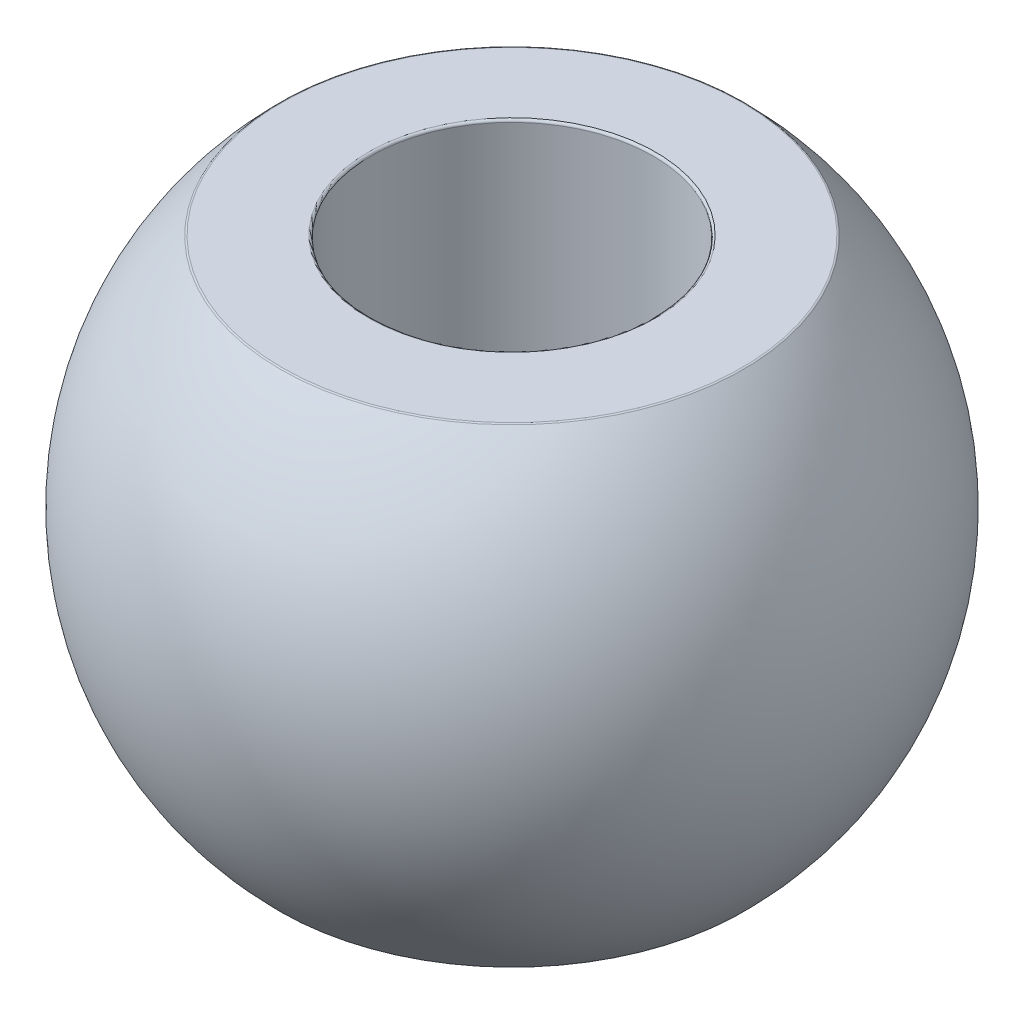
ISO-10303-21;
HEADER;
FILE_DESCRIPTION(('STEP AP214'),'2;1');
FILE_NAME('part.step','',(''),(''),'','','');
FILE_SCHEMA(('AUTOMOTIVE_DESIGN { 1 0 10303 214 1 1 1 1 }'));
ENDSEC;
DATA;
#1=APPLICATION_CONTEXT('core data for automotive mechanical design processes');
#2=APPLICATION_PROTOCOL_DEFINITION('international standard','automotive_design',2000,#1);
#3=PRODUCT_CONTEXT('',#1,'mechanical');
#4=PRODUCT('Part','Part','',(#3));
#5=PRODUCT_RELATED_PRODUCT_CATEGORY('part','',(#4));
#6=PRODUCT_DEFINITION_FORMATION('','',#4);
#7=PRODUCT_DEFINITION_CONTEXT('part definition',#1,'design');
#8=PRODUCT_DEFINITION('design','',#6,#7);
#9=PRODUCT_DEFINITION_SHAPE('','',#8);
#10=(LENGTH_UNIT() NAMED_UNIT(*) SI_UNIT(.MILLI.,.METRE.));
#11=(NAMED_UNIT(*) PLANE_ANGLE_UNIT() SI_UNIT($,.RADIAN.));
#12=(NAMED_UNIT(*) SI_UNIT($,.STERADIAN.) SOLID_ANGLE_UNIT());
#13=UNCERTAINTY_MEASURE_WITH_UNIT(LENGTH_MEASURE(1.E-05),#10,'distance_accuracy_value','');
#14=(GEOMETRIC_REPRESENTATION_CONTEXT(3) GLOBAL_UNCERTAINTY_ASSIGNED_CONTEXT((#13)) GLOBAL_UNIT_ASSIGNED_CONTEXT((#10,
#11,#12)) REPRESENTATION_CONTEXT('',''));
#15=CARTESIAN_POINT('',(0.,0.,0.));
#16=DIRECTION('',(0.,0.,1.));
#17=DIRECTION('',(1.,0.,0.));
#18=AXIS2_PLACEMENT_3D('',#15,#16,#17);
#19=CARTESIAN_POINT('',(6.,-10.,0.));
#20=DIRECTION('',(0.,-1.,0.));
#21=DIRECTION('',(0.,0.,-1.));
#22=AXIS2_PLACEMENT_3D('',#19,#20,#21);
#23=PLANE('',#22);
#24=CARTESIAN_POINT('',(0.,-10.,0.));
#25=DIRECTION('',(0.,-1.,0.));
#26=DIRECTION('',(0.,0.,-1.));
#27=AXIS2_PLACEMENT_3D('',#24,#25,#26);
#28=CIRCLE('',#27,9.75704873412037);
#29=CARTESIAN_POINT('',(0.,-10.,-9.75704873412037));
#30=VERTEX_POINT('',#29);
#31=EDGE_CURVE('E59',#30,#30,#28,.T.);
#32=ORIENTED_EDGE('',*,*,#31,.T.);
#33=EDGE_LOOP('',(#32));
#34=FACE_BOUND('',#33,.T.);
#35=CARTESIAN_POINT('',(0.,-10.,0.));
#36=DIRECTION('',(0.,-1.,0.));
#37=DIRECTION('',(0.,0.,-1.));
#38=AXIS2_PLACEMENT_3D('',#35,#36,#37);
#39=CIRCLE('',#38,6.1);
#40=CARTESIAN_POINT('',(0.,-10.,-6.1));
#41=VERTEX_POINT('',#40);
#42=EDGE_CURVE('E62',#41,#41,#39,.F.);
#43=ORIENTED_EDGE('',*,*,#42,.T.);
#44=EDGE_LOOP('',(#43));
#45=FACE_BOUND('',#44,.T.);
#46=ADVANCED_FACE('F33',(#34,#45),#23,.T.);
#47=CARTESIAN_POINT('',(0.,0.,0.));
#48=DIRECTION('',(0.,-1.,0.));
#49=DIRECTION('',(0.,0.,-1.));
#50=AXIS2_PLACEMENT_3D('',#47,#48,#49);
#51=CYLINDRICAL_SURFACE('',#50,6.);
#52=CARTESIAN_POINT('',(0.,9.9,0.));
#53=DIRECTION('',(0.,1.,0.));
#54=DIRECTION('',(0.,0.,1.));
#55=AXIS2_PLACEMENT_3D('',#52,#53,#54);
#56=CIRCLE('',#55,6.);
#57=CARTESIAN_POINT('',(0.,9.9,6.));
#58=VERTEX_POINT('',#57);
#59=EDGE_CURVE('E10',#58,#58,#56,.T.);
#60=ORIENTED_EDGE('',*,*,#59,.T.);
#61=EDGE_LOOP('',(#60));
#62=FACE_BOUND('',#61,.T.);
#63=CARTESIAN_POINT('',(0.,-9.9,0.));
#64=DIRECTION('',(0.,-1.,0.));
#65=DIRECTION('',(0.,0.,-1.));
#66=AXIS2_PLACEMENT_3D('',#63,#64,#65);
#67=CIRCLE('',#66,6.);
#68=CARTESIAN_POINT('',(0.,-9.9,-6.));
#69=VERTEX_POINT('',#68);
#70=EDGE_CURVE('E40',#69,#69,#67,.T.);
#71=ORIENTED_EDGE('',*,*,#70,.T.);
#72=EDGE_LOOP('',(#71));
#73=FACE_BOUND('',#72,.T.);
#74=ADVANCED_FACE('F76',(#62,#73),#51,.F.);
#75=CARTESIAN_POINT('',(6.,10.,0.));
#76=DIRECTION('',(0.,1.,0.));
#77=DIRECTION('',(0.,0.,1.));
#78=AXIS2_PLACEMENT_3D('',#75,#76,#77);
#79=PLANE('',#78);
#80=CARTESIAN_POINT('',(0.,10.,0.));
#81=DIRECTION('',(0.,1.,0.));
#82=DIRECTION('',(0.,0.,1.));
#83=AXIS2_PLACEMENT_3D('',#80,#81,#82);
#84=CIRCLE('',#83,9.75704873412037);
#85=CARTESIAN_POINT('',(0.,10.,9.75704873412037));
#86=VERTEX_POINT('',#85);
#87=EDGE_CURVE('E44',#86,#86,#84,.T.);
#88=ORIENTED_EDGE('',*,*,#87,.T.);
#89=EDGE_LOOP('',(#88));
#90=FACE_BOUND('',#89,.T.);
#91=CARTESIAN_POINT('',(0.,10.,0.));
#92=DIRECTION('',(0.,1.,0.));
#93=DIRECTION('',(0.,0.,1.));
#94=AXIS2_PLACEMENT_3D('',#91,#92,#93);
#95=CIRCLE('',#94,6.1);
#96=CARTESIAN_POINT('',(0.,10.,6.1));
#97=VERTEX_POINT('',#96);
#98=EDGE_CURVE('E48',#97,#97,#95,.F.);
#99=ORIENTED_EDGE('',*,*,#98,.T.);
#100=EDGE_LOOP('',(#99));
#101=FACE_BOUND('',#100,.T.);
#102=ADVANCED_FACE('F82',(#90,#101),#79,.T.);
#103=CARTESIAN_POINT('',(0.,0.,0.));
#104=DIRECTION('',(0.,-1.,0.));
#105=DIRECTION('',(1.,0.,0.));
#106=AXIS2_PLACEMENT_3D('',#103,#104,#105);
#107=SPHERICAL_SURFACE('',#106,14.);
#108=CARTESIAN_POINT('',(0.,-9.97122302158274,0.));
#109=DIRECTION('',(0.,1.,0.));
#110=DIRECTION('',(0.,0.,1.));
#111=AXIS2_PLACEMENT_3D('',#108,#109,#110);
#112=CIRCLE('',#111,9.82724332932987);
#113=CARTESIAN_POINT('',(0.,-9.97122302158274,9.82724332932987));
#114=VERTEX_POINT('',#113);
#115=EDGE_CURVE('E53',#114,#114,#112,.T.);
#116=ORIENTED_EDGE('',*,*,#115,.T.);
#117=EDGE_LOOP('',(#116));
#118=FACE_BOUND('',#117,.T.);
#119=CARTESIAN_POINT('',(0.,9.97122302158274,0.));
#120=DIRECTION('',(0.,-1.,0.));
#121=DIRECTION('',(0.,0.,-1.));
#122=AXIS2_PLACEMENT_3D('',#119,#120,#121);
#123=CIRCLE('',#122,9.82724332932987);
#124=CARTESIAN_POINT('',(0.,9.97122302158274,-9.82724332932987));
#125=VERTEX_POINT('',#124);
#126=EDGE_CURVE('E56',#125,#125,#123,.T.);
#127=ORIENTED_EDGE('',*,*,#126,.T.);
#128=EDGE_LOOP('',(#127));
#129=FACE_BOUND('',#128,.T.);
#130=ADVANCED_FACE('F89',(#118,#129),#107,.T.);
#131=CARTESIAN_POINT('',(0.,-9.9,0.));
#132=DIRECTION('',(0.,-1.,0.));
#133=DIRECTION('',(0.,0.,-1.));
#134=AXIS2_PLACEMENT_3D('',#131,#132,#133);
#135=TOROIDAL_SURFACE('',#134,9.75704873412037,0.1);
#136=ORIENTED_EDGE('',*,*,#115,.F.);
#137=EDGE_LOOP('',(#136));
#138=FACE_BOUND('',#137,.T.);
#139=ORIENTED_EDGE('',*,*,#31,.F.);
#140=EDGE_LOOP('',(#139));
#141=FACE_BOUND('',#140,.T.);
#142=ADVANCED_FACE('F86',(#138,#141),#135,.T.);
#143=CARTESIAN_POINT('',(0.,9.9,0.));
#144=DIRECTION('',(0.,1.,0.));
#145=DIRECTION('',(0.,0.,1.));
#146=AXIS2_PLACEMENT_3D('',#143,#144,#145);
#147=TOROIDAL_SURFACE('',#146,9.75704873412037,0.1);
#148=ORIENTED_EDGE('',*,*,#87,.F.);
#149=EDGE_LOOP('',(#148));
#150=FACE_BOUND('',#149,.T.);
#151=ORIENTED_EDGE('',*,*,#126,.F.);
#152=EDGE_LOOP('',(#151));
#153=FACE_BOUND('',#152,.T.);
#154=ADVANCED_FACE('F73',(#150,#153),#147,.T.);
#155=CARTESIAN_POINT('',(0.,9.9,0.));
#156=DIRECTION('',(0.,1.,0.));
#157=DIRECTION('',(0.,0.,1.));
#158=AXIS2_PLACEMENT_3D('',#155,#156,#157);
#159=TOROIDAL_SURFACE('',#158,6.1,0.1);
#160=ORIENTED_EDGE('',*,*,#59,.F.);
#161=EDGE_LOOP('',(#160));
#162=FACE_BOUND('',#161,.T.);
#163=ORIENTED_EDGE('',*,*,#98,.F.);
#164=EDGE_LOOP('',(#163));
#165=FACE_BOUND('',#164,.T.);
#166=ADVANCED_FACE('F69',(#162,#165),#159,.T.);
#167=CARTESIAN_POINT('',(0.,-9.9,0.));
#168=DIRECTION('',(0.,-1.,0.));
#169=DIRECTION('',(0.,0.,-1.));
#170=AXIS2_PLACEMENT_3D('',#167,#168,#169);
#171=TOROIDAL_SURFACE('',#170,6.1,0.1);
#172=ORIENTED_EDGE('',*,*,#42,.F.);
#173=EDGE_LOOP('',(#172));
#174=FACE_BOUND('',#173,.T.);
#175=ORIENTED_EDGE('',*,*,#70,.F.);
#176=EDGE_LOOP('',(#175));
#177=FACE_BOUND('',#176,.T.);
#178=ADVANCED_FACE('F35',(#174,#177),#171,.T.);
#179=CLOSED_SHELL('',(#46,#74,#102,#130,#142,#154,#166,#178));
#180=MANIFOLD_SOLID_BREP('B2',#179);
#181=ADVANCED_BREP_SHAPE_REPRESENTATION('',(#18,#180),#14);
#182=SHAPE_DEFINITION_REPRESENTATION(#9,#181);
ENDSEC;
END-ISO-10303-21;
